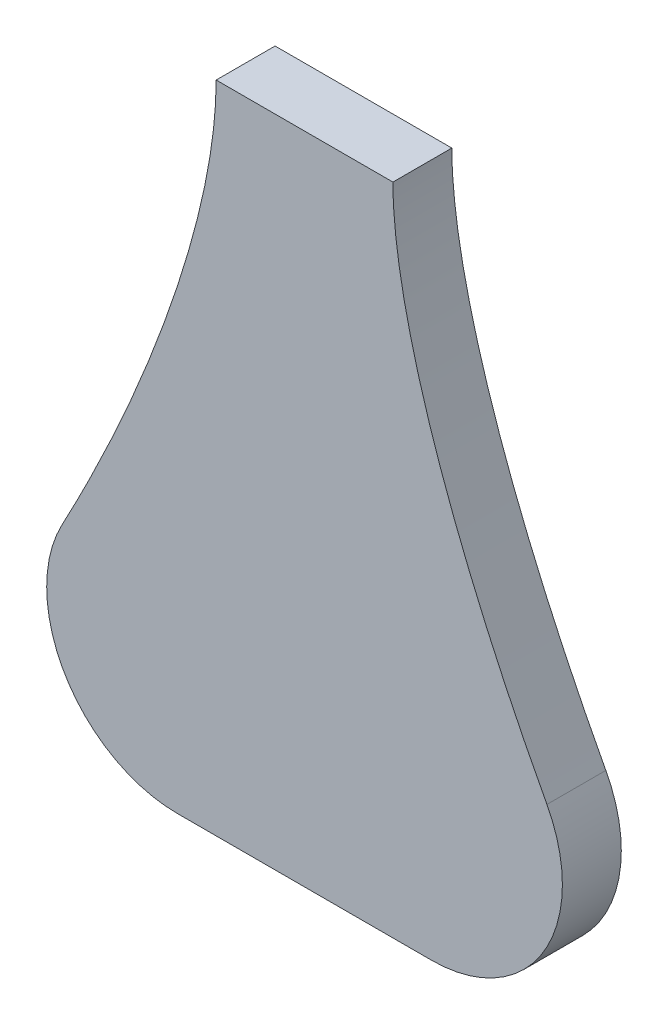
ISO-10303-21;
HEADER;
FILE_DESCRIPTION(('STEP AP214'),'2;1');
FILE_NAME('part.step','',(''),(''),'','','');
FILE_SCHEMA(('AUTOMOTIVE_DESIGN { 1 0 10303 214 1 1 1 1 }'));
ENDSEC;
DATA;
#1=APPLICATION_CONTEXT('core data for automotive mechanical design processes');
#2=APPLICATION_PROTOCOL_DEFINITION('international standard','automotive_design',2000,#1);
#3=PRODUCT_CONTEXT('',#1,'mechanical');
#4=PRODUCT('Part','Part','',(#3));
#5=PRODUCT_RELATED_PRODUCT_CATEGORY('part','',(#4));
#6=PRODUCT_DEFINITION_FORMATION('','',#4);
#7=PRODUCT_DEFINITION_CONTEXT('part definition',#1,'design');
#8=PRODUCT_DEFINITION('design','',#6,#7);
#9=PRODUCT_DEFINITION_SHAPE('','',#8);
#10=(LENGTH_UNIT() NAMED_UNIT(*) SI_UNIT(.MILLI.,.METRE.));
#11=(NAMED_UNIT(*) PLANE_ANGLE_UNIT() SI_UNIT($,.RADIAN.));
#12=(NAMED_UNIT(*) SI_UNIT($,.STERADIAN.) SOLID_ANGLE_UNIT());
#13=UNCERTAINTY_MEASURE_WITH_UNIT(LENGTH_MEASURE(1.E-05),#10,'distance_accuracy_value','');
#14=(GEOMETRIC_REPRESENTATION_CONTEXT(3) GLOBAL_UNCERTAINTY_ASSIGNED_CONTEXT((#13)) GLOBAL_UNIT_ASSIGNED_CONTEXT((#10,
#11,#12)) REPRESENTATION_CONTEXT('',''));
#15=CARTESIAN_POINT('',(0.,0.,0.));
#16=DIRECTION('',(0.,0.,1.));
#17=DIRECTION('',(1.,0.,0.));
#18=AXIS2_PLACEMENT_3D('',#15,#16,#17);
#19=CARTESIAN_POINT('',(110.,-200.,18.));
#20=CARTESIAN_POINT('',(64.5943515513242,-134.908704780999,18.));
#21=CARTESIAN_POINT('',(27.,-49.0264255910964,18.));
#22=CARTESIAN_POINT('',(27.,0.,18.));
#23=B_SPLINE_CURVE_WITH_KNOTS('',3,(#19,#20,#21,#22),.UNSPECIFIED.,.F.,.F.,(4,4),(0.,1.),.UNSPECIFIED.);
#24=DIRECTION('',(0.,0.,-1.));
#25=VECTOR('',#24,1.);
#26=SURFACE_OF_LINEAR_EXTRUSION('',#23,#25);
#27=CARTESIAN_POINT('',(74.0531917086111,-141.143646377657,18.));
#28=VERTEX_POINT('',#27);
#29=CARTESIAN_POINT('',(27.,0.,18.));
#30=VERTEX_POINT('',#29);
#31=EDGE_CURVE('E88',#28,#30,#23,.T.);
#32=ORIENTED_EDGE('',*,*,#31,.F.);
#33=DIRECTION('',(0.,0.,-1.));
#34=VECTOR('',#33,1.);
#35=CARTESIAN_POINT('',(74.0531917086055,-141.143646377646,18.));
#36=LINE('',#35,#34);
#37=CARTESIAN_POINT('',(74.0531917086055,-141.143646377646,0.));
#38=VERTEX_POINT('',#37);
#39=EDGE_CURVE('E11',#28,#38,#36,.T.);
#40=ORIENTED_EDGE('',*,*,#39,.T.);
#41=CARTESIAN_POINT('',(110.,-200.,0.));
#42=CARTESIAN_POINT('',(64.5943515513242,-134.908704780999,0.));
#43=CARTESIAN_POINT('',(27.,-49.0264255910964,0.));
#44=CARTESIAN_POINT('',(27.,0.,0.));
#45=B_SPLINE_CURVE_WITH_KNOTS('',3,(#41,#42,#43,#44),.UNSPECIFIED.,.F.,.F.,(4,4),(0.,1.),.UNSPECIFIED.);
#46=CARTESIAN_POINT('',(27.,0.,0.));
#47=VERTEX_POINT('',#46);
#48=EDGE_CURVE('E107',#38,#47,#45,.T.);
#49=ORIENTED_EDGE('',*,*,#48,.T.);
#50=DIRECTION('',(0.,0.,-1.));
#51=VECTOR('',#50,1.);
#52=CARTESIAN_POINT('',(27.,0.,18.));
#53=LINE('',#52,#51);
#54=EDGE_CURVE('E101',#30,#47,#53,.T.);
#55=ORIENTED_EDGE('',*,*,#54,.F.);
#56=EDGE_LOOP('',(#32,#40,#49,#55));
#57=FACE_BOUND('',#56,.T.);
#58=ADVANCED_FACE('F35',(#57),#26,.F.);
#59=CARTESIAN_POINT('',(-27.,0.,18.));
#60=DIRECTION('',(0.,-1.,0.));
#61=DIRECTION('',(0.,0.,-1.));
#62=AXIS2_PLACEMENT_3D('',#59,#60,#61);
#63=PLANE('',#62);
#64=DIRECTION('',(-1.,0.,0.));
#65=VECTOR('',#64,1.);
#66=CARTESIAN_POINT('',(-27.,0.,0.));
#67=LINE('',#66,#65);
#68=CARTESIAN_POINT('',(-27.,0.,0.));
#69=VERTEX_POINT('',#68);
#70=EDGE_CURVE('E140',#47,#69,#67,.T.);
#71=ORIENTED_EDGE('',*,*,#70,.T.);
#72=DIRECTION('',(0.,0.,-1.));
#73=VECTOR('',#72,1.);
#74=CARTESIAN_POINT('',(-27.,0.,18.));
#75=LINE('',#74,#73);
#76=CARTESIAN_POINT('',(-27.,0.,18.));
#77=VERTEX_POINT('',#76);
#78=EDGE_CURVE('E103',#77,#69,#75,.T.);
#79=ORIENTED_EDGE('',*,*,#78,.F.);
#80=DIRECTION('',(-1.,0.,0.));
#81=VECTOR('',#80,1.);
#82=CARTESIAN_POINT('',(-27.,0.,18.));
#83=LINE('',#82,#81);
#84=EDGE_CURVE('E91',#30,#77,#83,.T.);
#85=ORIENTED_EDGE('',*,*,#84,.F.);
#86=ORIENTED_EDGE('',*,*,#54,.T.);
#87=EDGE_LOOP('',(#71,#79,#85,#86));
#88=FACE_BOUND('',#87,.T.);
#89=ADVANCED_FACE('F100',(#88),#63,.F.);
#90=CARTESIAN_POINT('',(-27.,0.,18.));
#91=CARTESIAN_POINT('',(-27.,-49.0264255910964,18.));
#92=CARTESIAN_POINT('',(-64.5943515513242,-134.908704780999,18.));
#93=CARTESIAN_POINT('',(-110.,-200.,18.));
#94=B_SPLINE_CURVE_WITH_KNOTS('',3,(#90,#91,#92,#93),.UNSPECIFIED.,.F.,.F.,(4,4),(0.,1.),.UNSPECIFIED.);
#95=DIRECTION('',(0.,0.,-1.));
#96=VECTOR('',#95,1.);
#97=SURFACE_OF_LINEAR_EXTRUSION('',#94,#96);
#98=CARTESIAN_POINT('',(-27.,0.,0.));
#99=CARTESIAN_POINT('',(-27.,-49.0264255910964,0.));
#100=CARTESIAN_POINT('',(-64.5943515513242,-134.908704780999,0.));
#101=CARTESIAN_POINT('',(-110.,-200.,0.));
#102=B_SPLINE_CURVE_WITH_KNOTS('',3,(#98,#99,#100,#101),.UNSPECIFIED.,.F.,.F.,(4,4),(0.,1.),.UNSPECIFIED.);
#103=CARTESIAN_POINT('',(-74.0531917086056,-141.143646377646,0.));
#104=VERTEX_POINT('',#103);
#105=EDGE_CURVE('E138',#69,#104,#102,.T.);
#106=ORIENTED_EDGE('',*,*,#105,.T.);
#107=DIRECTION('',(0.,0.,-1.));
#108=VECTOR('',#107,1.);
#109=CARTESIAN_POINT('',(-74.0531917086056,-141.143646377646,0.));
#110=LINE('',#109,#108);
#111=CARTESIAN_POINT('',(-74.0531917086056,-141.143646377646,18.));
#112=VERTEX_POINT('',#111);
#113=EDGE_CURVE('E58',#104,#112,#110,.F.);
#114=ORIENTED_EDGE('',*,*,#113,.T.);
#115=EDGE_CURVE('E104',#77,#112,#94,.T.);
#116=ORIENTED_EDGE('',*,*,#115,.F.);
#117=ORIENTED_EDGE('',*,*,#78,.T.);
#118=EDGE_LOOP('',(#106,#114,#116,#117));
#119=FACE_BOUND('',#118,.T.);
#120=ADVANCED_FACE('F139',(#119),#97,.F.);
#121=CARTESIAN_POINT('',(110.,-200.,18.));
#122=DIRECTION('',(0.,1.,0.));
#123=DIRECTION('',(-1.,0.,0.));
#124=AXIS2_PLACEMENT_3D('',#121,#122,#123);
#125=PLANE('',#124);
#126=DIRECTION('',(1.,0.,0.));
#127=VECTOR('',#126,1.);
#128=CARTESIAN_POINT('',(110.,-200.,18.));
#129=LINE('',#128,#127);
#130=CARTESIAN_POINT('',(-38.7765999221427,-200.000000000001,18.));
#131=VERTEX_POINT('',#130);
#132=CARTESIAN_POINT('',(38.776599922143,-200.,18.));
#133=VERTEX_POINT('',#132);
#134=EDGE_CURVE('E113',#131,#133,#129,.T.);
#135=ORIENTED_EDGE('',*,*,#134,.F.);
#136=DIRECTION('',(0.,0.,-1.));
#137=VECTOR('',#136,1.);
#138=CARTESIAN_POINT('',(-38.7765999221428,-200.000000000001,18.));
#139=LINE('',#138,#137);
#140=CARTESIAN_POINT('',(-38.7765999221427,-200.000000000001,0.));
#141=VERTEX_POINT('',#140);
#142=EDGE_CURVE('E111',#131,#141,#139,.T.);
#143=ORIENTED_EDGE('',*,*,#142,.T.);
#144=DIRECTION('',(1.,0.,0.));
#145=VECTOR('',#144,1.);
#146=CARTESIAN_POINT('',(110.,-200.,0.));
#147=LINE('',#146,#145);
#148=CARTESIAN_POINT('',(38.776599922143,-200.,0.));
#149=VERTEX_POINT('',#148);
#150=EDGE_CURVE('E96',#141,#149,#147,.T.);
#151=ORIENTED_EDGE('',*,*,#150,.T.);
#152=DIRECTION('',(0.,0.,-1.));
#153=VECTOR('',#152,1.);
#154=CARTESIAN_POINT('',(38.776599922143,-200.,18.));
#155=LINE('',#154,#153);
#156=EDGE_CURVE('E109',#149,#133,#155,.F.);
#157=ORIENTED_EDGE('',*,*,#156,.T.);
#158=EDGE_LOOP('',(#135,#143,#151,#157));
#159=FACE_BOUND('',#158,.T.);
#160=ADVANCED_FACE('F129',(#159),#125,.F.);
#161=CARTESIAN_POINT('',(51.4728818317466,-93.9756738895357,18.));
#162=DIRECTION('',(0.,0.,-1.));
#163=DIRECTION('',(-1.,0.,0.));
#164=AXIS2_PLACEMENT_3D('',#161,#162,#163);
#165=PLANE('',#164);
#166=ORIENTED_EDGE('',*,*,#115,.T.);
#167=CARTESIAN_POINT('',(-38.7765999221429,-160.000000000001,18.));
#168=DIRECTION('',(0.,0.,-1.));
#169=DIRECTION('',(-1.,0.,0.));
#170=AXIS2_PLACEMENT_3D('',#167,#168,#169);
#171=CIRCLE('',#170,40.);
#172=EDGE_CURVE('E43',#112,#131,#171,.F.);
#173=ORIENTED_EDGE('',*,*,#172,.T.);
#174=ORIENTED_EDGE('',*,*,#134,.T.);
#175=CARTESIAN_POINT('',(38.7765999221428,-160.,18.));
#176=DIRECTION('',(0.,0.,-1.));
#177=DIRECTION('',(-1.,0.,0.));
#178=AXIS2_PLACEMENT_3D('',#175,#176,#177);
#179=CIRCLE('',#178,40.);
#180=EDGE_CURVE('E50',#133,#28,#179,.F.);
#181=ORIENTED_EDGE('',*,*,#180,.T.);
#182=ORIENTED_EDGE('',*,*,#31,.T.);
#183=ORIENTED_EDGE('',*,*,#84,.T.);
#184=EDGE_LOOP('',(#166,#173,#174,#181,#182,#183));
#185=FACE_BOUND('',#184,.T.);
#186=ADVANCED_FACE('F90',(#185),#165,.F.);
#187=CARTESIAN_POINT('',(51.4728818317466,-93.9756738895357,0.));
#188=DIRECTION('',(0.,0.,-1.));
#189=DIRECTION('',(-1.,0.,0.));
#190=AXIS2_PLACEMENT_3D('',#187,#188,#189);
#191=PLANE('',#190);
#192=ORIENTED_EDGE('',*,*,#150,.F.);
#193=CARTESIAN_POINT('',(-38.7765999221429,-160.000000000001,0.));
#194=DIRECTION('',(0.,0.,-1.));
#195=DIRECTION('',(-1.,0.,0.));
#196=AXIS2_PLACEMENT_3D('',#193,#194,#195);
#197=CIRCLE('',#196,40.);
#198=EDGE_CURVE('E121',#141,#104,#197,.T.);
#199=ORIENTED_EDGE('',*,*,#198,.T.);
#200=ORIENTED_EDGE('',*,*,#105,.F.);
#201=ORIENTED_EDGE('',*,*,#70,.F.);
#202=ORIENTED_EDGE('',*,*,#48,.F.);
#203=CARTESIAN_POINT('',(38.7765999221428,-160.,0.));
#204=DIRECTION('',(0.,0.,-1.));
#205=DIRECTION('',(-1.,0.,0.));
#206=AXIS2_PLACEMENT_3D('',#203,#204,#205);
#207=CIRCLE('',#206,40.);
#208=EDGE_CURVE('E119',#38,#149,#207,.T.);
#209=ORIENTED_EDGE('',*,*,#208,.T.);
#210=EDGE_LOOP('',(#192,#199,#200,#201,#202,#209));
#211=FACE_BOUND('',#210,.T.);
#212=ADVANCED_FACE('F137',(#211),#191,.T.);
#213=CARTESIAN_POINT('',(-38.7765999221429,-160.000000000001,9.));
#214=DIRECTION('',(0.,0.,-1.));
#215=DIRECTION('',(-1.,0.,0.));
#216=AXIS2_PLACEMENT_3D('',#213,#214,#215);
#217=CYLINDRICAL_SURFACE('',#216,40.);
#218=ORIENTED_EDGE('',*,*,#172,.F.);
#219=ORIENTED_EDGE('',*,*,#113,.F.);
#220=ORIENTED_EDGE('',*,*,#198,.F.);
#221=ORIENTED_EDGE('',*,*,#142,.F.);
#222=EDGE_LOOP('',(#218,#219,#220,#221));
#223=FACE_BOUND('',#222,.T.);
#224=ADVANCED_FACE('F134',(#223),#217,.T.);
#225=CARTESIAN_POINT('',(38.7765999221428,-160.,9.));
#226=DIRECTION('',(0.,0.,-1.));
#227=DIRECTION('',(-1.,0.,0.));
#228=AXIS2_PLACEMENT_3D('',#225,#226,#227);
#229=CYLINDRICAL_SURFACE('',#228,40.);
#230=ORIENTED_EDGE('',*,*,#180,.F.);
#231=ORIENTED_EDGE('',*,*,#156,.F.);
#232=ORIENTED_EDGE('',*,*,#208,.F.);
#233=ORIENTED_EDGE('',*,*,#39,.F.);
#234=EDGE_LOOP('',(#230,#231,#232,#233));
#235=FACE_BOUND('',#234,.T.);
#236=ADVANCED_FACE('F37',(#235),#229,.T.);
#237=CLOSED_SHELL('',(#58,#89,#120,#160,#186,#212,#224,#236));
#238=MANIFOLD_SOLID_BREP('B2',#237);
#239=ADVANCED_BREP_SHAPE_REPRESENTATION('',(#18,#238),#14);
#240=SHAPE_DEFINITION_REPRESENTATION(#9,#239);
ENDSEC;
END-ISO-10303-21;
